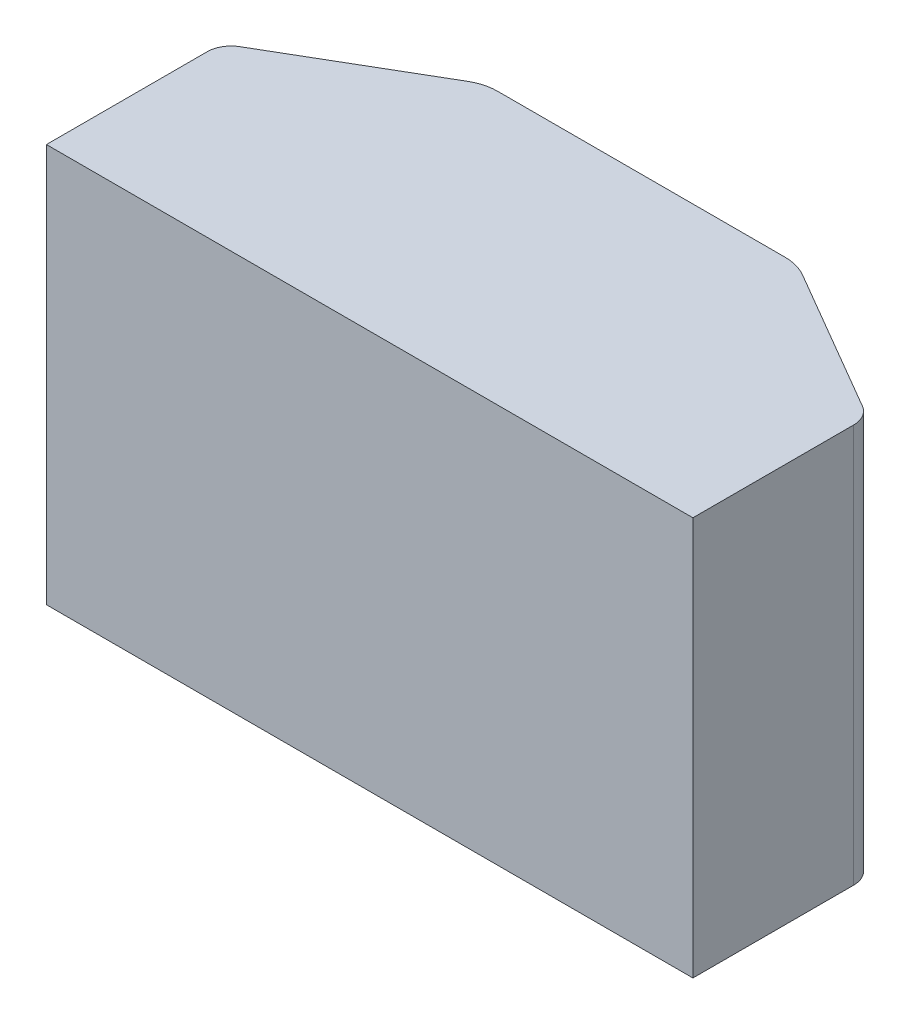
ISO-10303-21;
HEADER;
FILE_DESCRIPTION(('STEP AP214'),'2;1');
FILE_NAME('part.step','',(''),(''),'','','');
FILE_SCHEMA(('AUTOMOTIVE_DESIGN { 1 0 10303 214 1 1 1 1 }'));
ENDSEC;
DATA;
#1=APPLICATION_CONTEXT('core data for automotive mechanical design processes');
#2=APPLICATION_PROTOCOL_DEFINITION('international standard','automotive_design',2000,#1);
#3=PRODUCT_CONTEXT('',#1,'mechanical');
#4=PRODUCT('Part','Part','',(#3));
#5=PRODUCT_RELATED_PRODUCT_CATEGORY('part','',(#4));
#6=PRODUCT_DEFINITION_FORMATION('','',#4);
#7=PRODUCT_DEFINITION_CONTEXT('part definition',#1,'design');
#8=PRODUCT_DEFINITION('design','',#6,#7);
#9=PRODUCT_DEFINITION_SHAPE('','',#8);
#10=(LENGTH_UNIT() NAMED_UNIT(*) SI_UNIT(.MILLI.,.METRE.));
#11=(NAMED_UNIT(*) PLANE_ANGLE_UNIT() SI_UNIT($,.RADIAN.));
#12=(NAMED_UNIT(*) SI_UNIT($,.STERADIAN.) SOLID_ANGLE_UNIT());
#13=UNCERTAINTY_MEASURE_WITH_UNIT(LENGTH_MEASURE(1.E-05),#10,'distance_accuracy_value','');
#14=(GEOMETRIC_REPRESENTATION_CONTEXT(3) GLOBAL_UNCERTAINTY_ASSIGNED_CONTEXT((#13)) GLOBAL_UNIT_ASSIGNED_CONTEXT((#10,
#11,#12)) REPRESENTATION_CONTEXT('',''));
#15=CARTESIAN_POINT('',(0.,0.,0.));
#16=DIRECTION('',(0.,0.,1.));
#17=DIRECTION('',(1.,0.,0.));
#18=AXIS2_PLACEMENT_3D('',#15,#16,#17);
#19=CARTESIAN_POINT('',(0.,0.,57.));
#20=DIRECTION('',(1.,0.,0.));
#21=DIRECTION('',(0.,1.,0.));
#22=AXIS2_PLACEMENT_3D('',#19,#20,#21);
#23=PLANE('',#22);
#24=DIRECTION('',(0.,0.,-1.));
#25=VECTOR('',#24,1.);
#26=CARTESIAN_POINT('',(0.,0.,57.));
#27=LINE('',#26,#25);
#28=CARTESIAN_POINT('',(0.,0.,57.));
#29=VERTEX_POINT('',#28);
#30=CARTESIAN_POINT('',(0.,0.,23.2730332871596));
#31=VERTEX_POINT('',#30);
#32=EDGE_CURVE('E186',#29,#31,#27,.T.);
#33=ORIENTED_EDGE('',*,*,#32,.T.);
#34=DIRECTION('',(0.,1.,0.));
#35=VECTOR('',#34,1.);
#36=CARTESIAN_POINT('',(0.,0.,23.2730332871596));
#37=LINE('',#36,#35);
#38=CARTESIAN_POINT('',(0.,-83.6,23.2730332871596));
#39=VERTEX_POINT('',#38);
#40=EDGE_CURVE('E11',#31,#39,#37,.F.);
#41=ORIENTED_EDGE('',*,*,#40,.T.);
#42=DIRECTION('',(0.,0.,-1.));
#43=VECTOR('',#42,1.);
#44=CARTESIAN_POINT('',(0.,-83.6,57.));
#45=LINE('',#44,#43);
#46=CARTESIAN_POINT('',(0.,-83.6,57.));
#47=VERTEX_POINT('',#46);
#48=EDGE_CURVE('E115',#47,#39,#45,.T.);
#49=ORIENTED_EDGE('',*,*,#48,.F.);
#50=DIRECTION('',(0.,-1.,0.));
#51=VECTOR('',#50,1.);
#52=CARTESIAN_POINT('',(0.,0.,57.));
#53=LINE('',#52,#51);
#54=EDGE_CURVE('E121',#29,#47,#53,.T.);
#55=ORIENTED_EDGE('',*,*,#54,.F.);
#56=EDGE_LOOP('',(#33,#41,#49,#55));
#57=FACE_BOUND('',#56,.T.);
#58=ADVANCED_FACE('F36',(#57),#23,.F.);
#59=CARTESIAN_POINT('',(0.,-83.6,57.));
#60=DIRECTION('',(0.,1.,0.));
#61=DIRECTION('',(0.,0.,1.));
#62=AXIS2_PLACEMENT_3D('',#59,#60,#61);
#63=PLANE('',#62);
#64=DIRECTION('',(0.863957904990432,0.,0.503564036051566));
#65=VECTOR('',#64,1.);
#66=CARTESIAN_POINT('',(100.6,-83.6,0.));
#67=LINE('',#66,#65);
#68=CARTESIAN_POINT('',(102.934055551635,-83.6,1.36042095009568));
#69=VERTEX_POINT('',#68);
#70=CARTESIAN_POINT('',(133.117820180258,-83.6,18.9532437622074));
#71=VERTEX_POINT('',#70);
#72=EDGE_CURVE('E190',#69,#71,#67,.T.);
#73=ORIENTED_EDGE('',*,*,#72,.T.);
#74=CARTESIAN_POINT('',(130.6,-83.6,23.2730332871596));
#75=DIRECTION('',(0.,1.,0.));
#76=DIRECTION('',(0.,0.,1.));
#77=AXIS2_PLACEMENT_3D('',#74,#75,#76);
#78=CIRCLE('',#77,5.);
#79=CARTESIAN_POINT('',(135.6,-83.6,23.2730332871596));
#80=VERTEX_POINT('',#79);
#81=EDGE_CURVE('E165',#71,#80,#78,.F.);
#82=ORIENTED_EDGE('',*,*,#81,.T.);
#83=DIRECTION('',(0.,0.,-1.));
#84=VECTOR('',#83,1.);
#85=CARTESIAN_POINT('',(135.6,-83.6,57.));
#86=LINE('',#85,#84);
#87=CARTESIAN_POINT('',(135.6,-83.6,57.));
#88=VERTEX_POINT('',#87);
#89=EDGE_CURVE('E117',#88,#80,#86,.T.);
#90=ORIENTED_EDGE('',*,*,#89,.F.);
#91=DIRECTION('',(1.,0.,0.));
#92=VECTOR('',#91,1.);
#93=CARTESIAN_POINT('',(0.,-83.6,57.));
#94=LINE('',#93,#92);
#95=EDGE_CURVE('E111',#47,#88,#94,.T.);
#96=ORIENTED_EDGE('',*,*,#95,.F.);
#97=ORIENTED_EDGE('',*,*,#48,.T.);
#98=CARTESIAN_POINT('',(5.,-83.6,23.2730332871596));
#99=DIRECTION('',(0.,1.,0.));
#100=DIRECTION('',(0.,0.,1.));
#101=AXIS2_PLACEMENT_3D('',#98,#99,#100);
#102=CIRCLE('',#101,5.);
#103=CARTESIAN_POINT('',(2.48217981974216,-83.6,18.9532437622074));
#104=VERTEX_POINT('',#103);
#105=EDGE_CURVE('E51',#39,#104,#102,.F.);
#106=ORIENTED_EDGE('',*,*,#105,.T.);
#107=DIRECTION('',(0.863957904990433,0.,-0.503564036051566));
#108=VECTOR('',#107,1.);
#109=CARTESIAN_POINT('',(35.,-83.6,0.));
#110=LINE('',#109,#108);
#111=CARTESIAN_POINT('',(32.6659444483653,-83.6,1.36042095009568));
#112=VERTEX_POINT('',#111);
#113=EDGE_CURVE('E172',#104,#112,#110,.T.);
#114=ORIENTED_EDGE('',*,*,#113,.T.);
#115=CARTESIAN_POINT('',(37.7015848088809,-83.6,10.));
#116=DIRECTION('',(0.,1.,0.));
#117=DIRECTION('',(0.,0.,1.));
#118=AXIS2_PLACEMENT_3D('',#115,#116,#117);
#119=CIRCLE('',#118,10.);
#120=CARTESIAN_POINT('',(37.7015848088809,-83.6,0.));
#121=VERTEX_POINT('',#120);
#122=EDGE_CURVE('E148',#112,#121,#119,.F.);
#123=ORIENTED_EDGE('',*,*,#122,.T.);
#124=DIRECTION('',(1.,0.,0.));
#125=VECTOR('',#124,1.);
#126=CARTESIAN_POINT('',(0.,-83.6,0.));
#127=LINE('',#126,#125);
#128=CARTESIAN_POINT('',(97.8984151911191,-83.6,0.));
#129=VERTEX_POINT('',#128);
#130=EDGE_CURVE('E187',#121,#129,#127,.T.);
#131=ORIENTED_EDGE('',*,*,#130,.T.);
#132=CARTESIAN_POINT('',(97.8984151911191,-83.6,10.));
#133=DIRECTION('',(0.,1.,0.));
#134=DIRECTION('',(0.,0.,1.));
#135=AXIS2_PLACEMENT_3D('',#132,#133,#134);
#136=CIRCLE('',#135,10.);
#137=EDGE_CURVE('E150',#129,#69,#136,.F.);
#138=ORIENTED_EDGE('',*,*,#137,.T.);
#139=EDGE_LOOP('',(#73,#82,#90,#96,#97,#106,#114,#123,#131,#138));
#140=FACE_BOUND('',#139,.T.);
#141=ADVANCED_FACE('F114',(#140),#63,.F.);
#142=CARTESIAN_POINT('',(135.6,0.,57.));
#143=DIRECTION('',(-1.,0.,0.));
#144=DIRECTION('',(0.,0.,1.));
#145=AXIS2_PLACEMENT_3D('',#142,#143,#144);
#146=PLANE('',#145);
#147=ORIENTED_EDGE('',*,*,#89,.T.);
#148=DIRECTION('',(0.,1.,0.));
#149=VECTOR('',#148,1.);
#150=CARTESIAN_POINT('',(135.6,0.,23.2730332871596));
#151=LINE('',#150,#149);
#152=CARTESIAN_POINT('',(135.6,0.,23.2730332871596));
#153=VERTEX_POINT('',#152);
#154=EDGE_CURVE('E155',#80,#153,#151,.T.);
#155=ORIENTED_EDGE('',*,*,#154,.T.);
#156=DIRECTION('',(0.,0.,-1.));
#157=VECTOR('',#156,1.);
#158=CARTESIAN_POINT('',(135.6,0.,57.));
#159=LINE('',#158,#157);
#160=CARTESIAN_POINT('',(135.6,0.,57.));
#161=VERTEX_POINT('',#160);
#162=EDGE_CURVE('E135',#161,#153,#159,.T.);
#163=ORIENTED_EDGE('',*,*,#162,.F.);
#164=DIRECTION('',(0.,1.,0.));
#165=VECTOR('',#164,1.);
#166=CARTESIAN_POINT('',(135.6,0.,57.));
#167=LINE('',#166,#165);
#168=EDGE_CURVE('E120',#88,#161,#167,.T.);
#169=ORIENTED_EDGE('',*,*,#168,.F.);
#170=EDGE_LOOP('',(#147,#155,#163,#169));
#171=FACE_BOUND('',#170,.T.);
#172=ADVANCED_FACE('F196',(#171),#146,.F.);
#173=CARTESIAN_POINT('',(0.,0.,57.));
#174=DIRECTION('',(0.,-1.,0.));
#175=DIRECTION('',(0.,0.,-1.));
#176=AXIS2_PLACEMENT_3D('',#173,#174,#175);
#177=PLANE('',#176);
#178=ORIENTED_EDGE('',*,*,#162,.T.);
#179=CARTESIAN_POINT('',(130.6,0.,23.2730332871596));
#180=DIRECTION('',(0.,-1.,0.));
#181=DIRECTION('',(0.,0.,-1.));
#182=AXIS2_PLACEMENT_3D('',#179,#180,#181);
#183=CIRCLE('',#182,5.);
#184=CARTESIAN_POINT('',(133.117820180258,0.,18.9532437622074));
#185=VERTEX_POINT('',#184);
#186=EDGE_CURVE('E160',#153,#185,#183,.F.);
#187=ORIENTED_EDGE('',*,*,#186,.T.);
#188=DIRECTION('',(0.863957904990432,0.,0.503564036051566));
#189=VECTOR('',#188,1.);
#190=CARTESIAN_POINT('',(100.6,0.,0.));
#191=LINE('',#190,#189);
#192=CARTESIAN_POINT('',(102.934055551635,0.,1.36042095009568));
#193=VERTEX_POINT('',#192);
#194=EDGE_CURVE('E180',#193,#185,#191,.T.);
#195=ORIENTED_EDGE('',*,*,#194,.F.);
#196=CARTESIAN_POINT('',(97.8984151911191,0.,10.));
#197=DIRECTION('',(0.,-1.,0.));
#198=DIRECTION('',(0.,0.,-1.));
#199=AXIS2_PLACEMENT_3D('',#196,#197,#198);
#200=CIRCLE('',#199,10.);
#201=CARTESIAN_POINT('',(97.8984151911191,0.,0.));
#202=VERTEX_POINT('',#201);
#203=EDGE_CURVE('E141',#193,#202,#200,.F.);
#204=ORIENTED_EDGE('',*,*,#203,.T.);
#205=DIRECTION('',(-1.,0.,0.));
#206=VECTOR('',#205,1.);
#207=CARTESIAN_POINT('',(0.,0.,0.));
#208=LINE('',#207,#206);
#209=CARTESIAN_POINT('',(37.7015848088809,0.,0.));
#210=VERTEX_POINT('',#209);
#211=EDGE_CURVE('E128',#202,#210,#208,.T.);
#212=ORIENTED_EDGE('',*,*,#211,.T.);
#213=CARTESIAN_POINT('',(37.7015848088809,0.,10.));
#214=DIRECTION('',(0.,-1.,0.));
#215=DIRECTION('',(0.,0.,-1.));
#216=AXIS2_PLACEMENT_3D('',#213,#214,#215);
#217=CIRCLE('',#216,10.);
#218=CARTESIAN_POINT('',(32.6659444483653,0.,1.36042095009568));
#219=VERTEX_POINT('',#218);
#220=EDGE_CURVE('E133',#210,#219,#217,.F.);
#221=ORIENTED_EDGE('',*,*,#220,.T.);
#222=DIRECTION('',(0.863957904990433,0.,-0.503564036051566));
#223=VECTOR('',#222,1.);
#224=CARTESIAN_POINT('',(35.,0.,0.));
#225=LINE('',#224,#223);
#226=CARTESIAN_POINT('',(2.48217981974215,0.,18.9532437622074));
#227=VERTEX_POINT('',#226);
#228=EDGE_CURVE('E171',#227,#219,#225,.T.);
#229=ORIENTED_EDGE('',*,*,#228,.F.);
#230=CARTESIAN_POINT('',(4.99999999999999,0.,23.2730332871596));
#231=DIRECTION('',(0.,-1.,0.));
#232=DIRECTION('',(0.,0.,-1.));
#233=AXIS2_PLACEMENT_3D('',#230,#231,#232);
#234=CIRCLE('',#233,5.);
#235=EDGE_CURVE('E158',#227,#31,#234,.F.);
#236=ORIENTED_EDGE('',*,*,#235,.T.);
#237=ORIENTED_EDGE('',*,*,#32,.F.);
#238=DIRECTION('',(-1.,0.,0.));
#239=VECTOR('',#238,1.);
#240=CARTESIAN_POINT('',(0.,0.,57.));
#241=LINE('',#240,#239);
#242=EDGE_CURVE('E126',#161,#29,#241,.T.);
#243=ORIENTED_EDGE('',*,*,#242,.F.);
#244=EDGE_LOOP('',(#178,#187,#195,#204,#212,#221,#229,#236,#237,#243));
#245=FACE_BOUND('',#244,.T.);
#246=ADVANCED_FACE('F176',(#245),#177,.F.);
#247=CARTESIAN_POINT('',(0.,0.,57.));
#248=DIRECTION('',(0.,0.,1.));
#249=DIRECTION('',(1.,0.,0.));
#250=AXIS2_PLACEMENT_3D('',#247,#248,#249);
#251=PLANE('',#250);
#252=ORIENTED_EDGE('',*,*,#54,.T.);
#253=ORIENTED_EDGE('',*,*,#95,.T.);
#254=ORIENTED_EDGE('',*,*,#168,.T.);
#255=ORIENTED_EDGE('',*,*,#242,.T.);
#256=EDGE_LOOP('',(#252,#253,#254,#255));
#257=FACE_BOUND('',#256,.T.);
#258=ADVANCED_FACE('F124',(#257),#251,.T.);
#259=CARTESIAN_POINT('',(0.,0.,0.));
#260=DIRECTION('',(0.,0.,1.));
#261=DIRECTION('',(1.,0.,0.));
#262=AXIS2_PLACEMENT_3D('',#259,#260,#261);
#263=PLANE('',#262);
#264=ORIENTED_EDGE('',*,*,#211,.F.);
#265=DIRECTION('',(0.,1.,0.));
#266=VECTOR('',#265,1.);
#267=CARTESIAN_POINT('',(97.8984151911191,0.,0.));
#268=LINE('',#267,#266);
#269=EDGE_CURVE('E146',#202,#129,#268,.F.);
#270=ORIENTED_EDGE('',*,*,#269,.T.);
#271=ORIENTED_EDGE('',*,*,#130,.F.);
#272=DIRECTION('',(0.,1.,0.));
#273=VECTOR('',#272,1.);
#274=CARTESIAN_POINT('',(37.7015848088809,0.,0.));
#275=LINE('',#274,#273);
#276=EDGE_CURVE('E143',#121,#210,#275,.T.);
#277=ORIENTED_EDGE('',*,*,#276,.T.);
#278=EDGE_LOOP('',(#264,#270,#271,#277));
#279=FACE_BOUND('',#278,.T.);
#280=ADVANCED_FACE('F214',(#279),#263,.F.);
#281=CARTESIAN_POINT('',(35.,-83.6,0.));
#282=DIRECTION('',(0.503564036051566,0.,0.863957904990432));
#283=DIRECTION('',(0.863957904990432,0.,-0.503564036051566));
#284=AXIS2_PLACEMENT_3D('',#281,#282,#283);
#285=PLANE('',#284);
#286=ORIENTED_EDGE('',*,*,#113,.F.);
#287=DIRECTION('',(0.,1.,0.));
#288=VECTOR('',#287,1.);
#289=CARTESIAN_POINT('',(2.48217981974218,-83.6,18.9532437622074));
#290=LINE('',#289,#288);
#291=EDGE_CURVE('E44',#104,#227,#290,.T.);
#292=ORIENTED_EDGE('',*,*,#291,.T.);
#293=ORIENTED_EDGE('',*,*,#228,.T.);
#294=DIRECTION('',(0.,1.,0.));
#295=VECTOR('',#294,1.);
#296=CARTESIAN_POINT('',(32.6659444483653,-83.6,1.36042095009568));
#297=LINE('',#296,#295);
#298=EDGE_CURVE('E152',#219,#112,#297,.F.);
#299=ORIENTED_EDGE('',*,*,#298,.T.);
#300=EDGE_LOOP('',(#286,#292,#293,#299));
#301=FACE_BOUND('',#300,.T.);
#302=ADVANCED_FACE('F170',(#301),#285,.F.);
#303=CARTESIAN_POINT('',(100.6,-83.6,0.));
#304=DIRECTION('',(-0.503564036051566,0.,0.863957904990432));
#305=DIRECTION('',(0.863957904990432,0.,0.503564036051566));
#306=AXIS2_PLACEMENT_3D('',#303,#304,#305);
#307=PLANE('',#306);
#308=ORIENTED_EDGE('',*,*,#194,.T.);
#309=DIRECTION('',(0.,1.,0.));
#310=VECTOR('',#309,1.);
#311=CARTESIAN_POINT('',(133.117820180258,-83.6,18.9532437622074));
#312=LINE('',#311,#310);
#313=EDGE_CURVE('E162',#185,#71,#312,.F.);
#314=ORIENTED_EDGE('',*,*,#313,.T.);
#315=ORIENTED_EDGE('',*,*,#72,.F.);
#316=DIRECTION('',(0.,1.,0.));
#317=VECTOR('',#316,1.);
#318=CARTESIAN_POINT('',(102.934055551635,-83.6,1.36042095009568));
#319=LINE('',#318,#317);
#320=EDGE_CURVE('E130',#69,#193,#319,.T.);
#321=ORIENTED_EDGE('',*,*,#320,.T.);
#322=EDGE_LOOP('',(#308,#314,#315,#321));
#323=FACE_BOUND('',#322,.T.);
#324=ADVANCED_FACE('F204',(#323),#307,.F.);
#325=CARTESIAN_POINT('',(97.8984151911191,-83.6,10.));
#326=DIRECTION('',(0.,1.,0.));
#327=DIRECTION('',(0.,0.,1.));
#328=AXIS2_PLACEMENT_3D('',#325,#326,#327);
#329=CYLINDRICAL_SURFACE('',#328,10.);
#330=ORIENTED_EDGE('',*,*,#137,.F.);
#331=ORIENTED_EDGE('',*,*,#269,.F.);
#332=ORIENTED_EDGE('',*,*,#203,.F.);
#333=ORIENTED_EDGE('',*,*,#320,.F.);
#334=EDGE_LOOP('',(#330,#331,#332,#333));
#335=FACE_BOUND('',#334,.T.);
#336=ADVANCED_FACE('F211',(#335),#329,.T.);
#337=CARTESIAN_POINT('',(37.7015848088809,0.,10.));
#338=DIRECTION('',(0.,1.,0.));
#339=DIRECTION('',(0.,0.,1.));
#340=AXIS2_PLACEMENT_3D('',#337,#338,#339);
#341=CYLINDRICAL_SURFACE('',#340,10.);
#342=ORIENTED_EDGE('',*,*,#122,.F.);
#343=ORIENTED_EDGE('',*,*,#298,.F.);
#344=ORIENTED_EDGE('',*,*,#220,.F.);
#345=ORIENTED_EDGE('',*,*,#276,.F.);
#346=EDGE_LOOP('',(#342,#343,#344,#345));
#347=FACE_BOUND('',#346,.T.);
#348=ADVANCED_FACE('F218',(#347),#341,.T.);
#349=CARTESIAN_POINT('',(130.6,0.,23.2730332871596));
#350=DIRECTION('',(0.,1.,0.));
#351=DIRECTION('',(0.,0.,1.));
#352=AXIS2_PLACEMENT_3D('',#349,#350,#351);
#353=CYLINDRICAL_SURFACE('',#352,5.);
#354=ORIENTED_EDGE('',*,*,#81,.F.);
#355=ORIENTED_EDGE('',*,*,#313,.F.);
#356=ORIENTED_EDGE('',*,*,#186,.F.);
#357=ORIENTED_EDGE('',*,*,#154,.F.);
#358=EDGE_LOOP('',(#354,#355,#356,#357));
#359=FACE_BOUND('',#358,.T.);
#360=ADVANCED_FACE('F200',(#359),#353,.T.);
#361=CARTESIAN_POINT('',(5.,-83.6,23.2730332871596));
#362=DIRECTION('',(0.,1.,0.));
#363=DIRECTION('',(-1.,0.,0.));
#364=AXIS2_PLACEMENT_3D('',#361,#362,#363);
#365=CYLINDRICAL_SURFACE('',#364,5.);
#366=ORIENTED_EDGE('',*,*,#105,.F.);
#367=ORIENTED_EDGE('',*,*,#40,.F.);
#368=ORIENTED_EDGE('',*,*,#235,.F.);
#369=ORIENTED_EDGE('',*,*,#291,.F.);
#370=EDGE_LOOP('',(#366,#367,#368,#369));
#371=FACE_BOUND('',#370,.T.);
#372=ADVANCED_FACE('F38',(#371),#365,.T.);
#373=CLOSED_SHELL('',(#58,#141,#172,#246,#258,#280,#302,#324,#336,#348,#360,#372));
#374=MANIFOLD_SOLID_BREP('B2',#373);
#375=ADVANCED_BREP_SHAPE_REPRESENTATION('',(#18,#374),#14);
#376=SHAPE_DEFINITION_REPRESENTATION(#9,#375);
ENDSEC;
END-ISO-10303-21;
